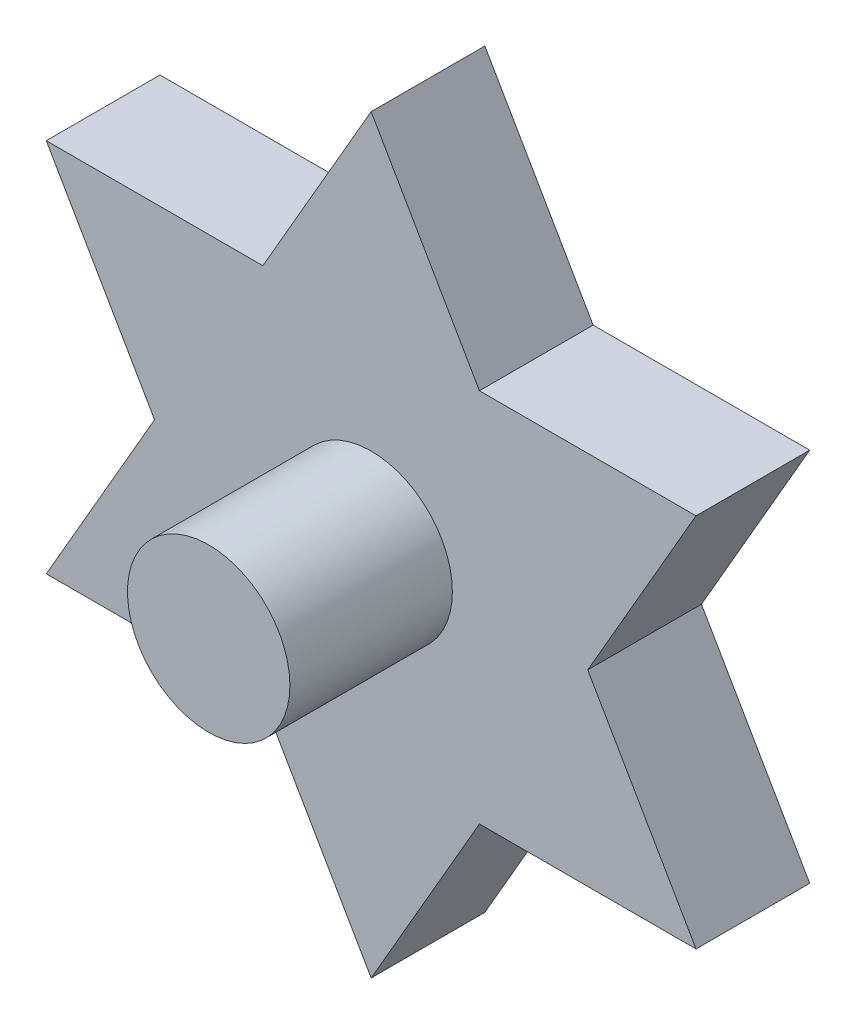
ISO-10303-21;
HEADER;
FILE_DESCRIPTION(('STEP AP214'),'2;1');
FILE_NAME('part.step','',(''),(''),'','','');
FILE_SCHEMA(('AUTOMOTIVE_DESIGN { 1 0 10303 214 1 1 1 1 }'));
ENDSEC;
DATA;
#1=APPLICATION_CONTEXT('core data for automotive mechanical design processes');
#2=APPLICATION_PROTOCOL_DEFINITION('international standard','automotive_design',2000,#1);
#3=PRODUCT_CONTEXT('',#1,'mechanical');
#4=PRODUCT('Part','Part','',(#3));
#5=PRODUCT_RELATED_PRODUCT_CATEGORY('part','',(#4));
#6=PRODUCT_DEFINITION_FORMATION('','',#4);
#7=PRODUCT_DEFINITION_CONTEXT('part definition',#1,'design');
#8=PRODUCT_DEFINITION('design','',#6,#7);
#9=PRODUCT_DEFINITION_SHAPE('','',#8);
#10=(LENGTH_UNIT() NAMED_UNIT(*) SI_UNIT(.MILLI.,.METRE.));
#11=(NAMED_UNIT(*) PLANE_ANGLE_UNIT() SI_UNIT($,.RADIAN.));
#12=(NAMED_UNIT(*) SI_UNIT($,.STERADIAN.) SOLID_ANGLE_UNIT());
#13=UNCERTAINTY_MEASURE_WITH_UNIT(LENGTH_MEASURE(1.E-05),#10,'distance_accuracy_value','');
#14=(GEOMETRIC_REPRESENTATION_CONTEXT(3) GLOBAL_UNCERTAINTY_ASSIGNED_CONTEXT((#13)) GLOBAL_UNIT_ASSIGNED_CONTEXT((#10,
#11,#12)) REPRESENTATION_CONTEXT('',''));
#15=CARTESIAN_POINT('',(0.,0.,0.));
#16=DIRECTION('',(0.,0.,1.));
#17=DIRECTION('',(1.,0.,0.));
#18=AXIS2_PLACEMENT_3D('',#15,#16,#17);
#19=CARTESIAN_POINT('',(-20.,-11.5470053837925,7.));
#20=DIRECTION('',(0.866025403784439,-0.5,0.));
#21=DIRECTION('',(0.5,0.866025403784439,0.));
#22=AXIS2_PLACEMENT_3D('',#19,#20,#21);
#23=PLANE('',#22);
#24=DIRECTION('',(-0.5,-0.866025403784439,0.));
#25=VECTOR('',#24,1.);
#26=CARTESIAN_POINT('',(-20.,-11.5470053837925,0.));
#27=LINE('',#26,#25);
#28=CARTESIAN_POINT('',(-13.3333333333333,0.,0.));
#29=VERTEX_POINT('',#28);
#30=CARTESIAN_POINT('',(-20.,-11.5470053837925,0.));
#31=VERTEX_POINT('',#30);
#32=EDGE_CURVE('E153',#29,#31,#27,.T.);
#33=ORIENTED_EDGE('',*,*,#32,.T.);
#34=DIRECTION('',(0.,0.,-1.));
#35=VECTOR('',#34,1.);
#36=CARTESIAN_POINT('',(-20.,-11.5470053837925,7.));
#37=LINE('',#36,#35);
#38=CARTESIAN_POINT('',(-20.,-11.5470053837925,7.));
#39=VERTEX_POINT('',#38);
#40=EDGE_CURVE('E11',#39,#31,#37,.T.);
#41=ORIENTED_EDGE('',*,*,#40,.F.);
#42=DIRECTION('',(-0.5,-0.866025403784439,0.));
#43=VECTOR('',#42,1.);
#44=CARTESIAN_POINT('',(-20.,-11.5470053837925,7.));
#45=LINE('',#44,#43);
#46=CARTESIAN_POINT('',(-13.3333333333333,0.,7.));
#47=VERTEX_POINT('',#46);
#48=EDGE_CURVE('E176',#47,#39,#45,.T.);
#49=ORIENTED_EDGE('',*,*,#48,.F.);
#50=DIRECTION('',(0.,0.,-1.));
#51=VECTOR('',#50,1.);
#52=CARTESIAN_POINT('',(-13.3333333333333,0.,7.));
#53=LINE('',#52,#51);
#54=EDGE_CURVE('E149',#47,#29,#53,.T.);
#55=ORIENTED_EDGE('',*,*,#54,.T.);
#56=EDGE_LOOP('',(#33,#41,#49,#55));
#57=FACE_BOUND('',#56,.T.);
#58=ADVANCED_FACE('F33',(#57),#23,.F.);
#59=CARTESIAN_POINT('',(-6.66666666666667,-11.5470053837925,7.));
#60=DIRECTION('',(0.,1.,0.));
#61=DIRECTION('',(0.,0.,1.));
#62=AXIS2_PLACEMENT_3D('',#59,#60,#61);
#63=PLANE('',#62);
#64=DIRECTION('',(1.,0.,0.));
#65=VECTOR('',#64,1.);
#66=CARTESIAN_POINT('',(-6.66666666666667,-11.5470053837925,0.));
#67=LINE('',#66,#65);
#68=CARTESIAN_POINT('',(-6.66666666666667,-11.5470053837925,0.));
#69=VERTEX_POINT('',#68);
#70=EDGE_CURVE('E156',#31,#69,#67,.T.);
#71=ORIENTED_EDGE('',*,*,#70,.T.);
#72=DIRECTION('',(0.,0.,-1.));
#73=VECTOR('',#72,1.);
#74=CARTESIAN_POINT('',(-6.66666666666667,-11.5470053837925,7.));
#75=LINE('',#74,#73);
#76=CARTESIAN_POINT('',(-6.66666666666667,-11.5470053837925,7.));
#77=VERTEX_POINT('',#76);
#78=EDGE_CURVE('E41',#77,#69,#75,.T.);
#79=ORIENTED_EDGE('',*,*,#78,.F.);
#80=DIRECTION('',(1.,0.,0.));
#81=VECTOR('',#80,1.);
#82=CARTESIAN_POINT('',(-6.66666666666667,-11.5470053837925,7.));
#83=LINE('',#82,#81);
#84=EDGE_CURVE('E104',#39,#77,#83,.T.);
#85=ORIENTED_EDGE('',*,*,#84,.F.);
#86=ORIENTED_EDGE('',*,*,#40,.T.);
#87=EDGE_LOOP('',(#71,#79,#85,#86));
#88=FACE_BOUND('',#87,.T.);
#89=ADVANCED_FACE('F255',(#88),#63,.F.);
#90=CARTESIAN_POINT('',(0.,-23.094010767585,7.));
#91=DIRECTION('',(0.866025403784439,0.5,0.));
#92=DIRECTION('',(-0.5,0.866025403784439,0.));
#93=AXIS2_PLACEMENT_3D('',#90,#91,#92);
#94=PLANE('',#93);
#95=DIRECTION('',(0.5,-0.866025403784439,0.));
#96=VECTOR('',#95,1.);
#97=CARTESIAN_POINT('',(0.,-23.094010767585,0.));
#98=LINE('',#97,#96);
#99=CARTESIAN_POINT('',(0.,-23.094010767585,0.));
#100=VERTEX_POINT('',#99);
#101=EDGE_CURVE('E159',#69,#100,#98,.T.);
#102=ORIENTED_EDGE('',*,*,#101,.T.);
#103=DIRECTION('',(0.,0.,-1.));
#104=VECTOR('',#103,1.);
#105=CARTESIAN_POINT('',(0.,-23.094010767585,7.));
#106=LINE('',#105,#104);
#107=CARTESIAN_POINT('',(0.,-23.094010767585,7.));
#108=VERTEX_POINT('',#107);
#109=EDGE_CURVE('E195',#108,#100,#106,.T.);
#110=ORIENTED_EDGE('',*,*,#109,.F.);
#111=DIRECTION('',(0.5,-0.866025403784439,0.));
#112=VECTOR('',#111,1.);
#113=CARTESIAN_POINT('',(0.,-23.094010767585,7.));
#114=LINE('',#113,#112);
#115=EDGE_CURVE('E203',#77,#108,#114,.T.);
#116=ORIENTED_EDGE('',*,*,#115,.F.);
#117=ORIENTED_EDGE('',*,*,#78,.T.);
#118=EDGE_LOOP('',(#102,#110,#116,#117));
#119=FACE_BOUND('',#118,.T.);
#120=ADVANCED_FACE('F201',(#119),#94,.F.);
#121=CARTESIAN_POINT('',(6.66666666666667,-11.5470053837925,7.));
#122=DIRECTION('',(-0.866025403784439,0.5,0.));
#123=DIRECTION('',(-0.5,-0.866025403784439,0.));
#124=AXIS2_PLACEMENT_3D('',#121,#122,#123);
#125=PLANE('',#124);
#126=DIRECTION('',(0.5,0.866025403784439,0.));
#127=VECTOR('',#126,1.);
#128=CARTESIAN_POINT('',(6.66666666666667,-11.5470053837925,0.));
#129=LINE('',#128,#127);
#130=CARTESIAN_POINT('',(6.66666666666667,-11.5470053837925,0.));
#131=VERTEX_POINT('',#130);
#132=EDGE_CURVE('E161',#100,#131,#129,.T.);
#133=ORIENTED_EDGE('',*,*,#132,.T.);
#134=DIRECTION('',(0.,0.,-1.));
#135=VECTOR('',#134,1.);
#136=CARTESIAN_POINT('',(6.66666666666667,-11.5470053837925,7.));
#137=LINE('',#136,#135);
#138=CARTESIAN_POINT('',(6.66666666666667,-11.5470053837925,7.));
#139=VERTEX_POINT('',#138);
#140=EDGE_CURVE('E192',#139,#131,#137,.T.);
#141=ORIENTED_EDGE('',*,*,#140,.F.);
#142=DIRECTION('',(0.5,0.866025403784439,0.));
#143=VECTOR('',#142,1.);
#144=CARTESIAN_POINT('',(6.66666666666667,-11.5470053837925,7.));
#145=LINE('',#144,#143);
#146=EDGE_CURVE('E221',#108,#139,#145,.T.);
#147=ORIENTED_EDGE('',*,*,#146,.F.);
#148=ORIENTED_EDGE('',*,*,#109,.T.);
#149=EDGE_LOOP('',(#133,#141,#147,#148));
#150=FACE_BOUND('',#149,.T.);
#151=ADVANCED_FACE('F212',(#150),#125,.F.);
#152=CARTESIAN_POINT('',(20.,-11.5470053837925,7.));
#153=DIRECTION('',(0.,1.,0.));
#154=DIRECTION('',(0.,0.,1.));
#155=AXIS2_PLACEMENT_3D('',#152,#153,#154);
#156=PLANE('',#155);
#157=DIRECTION('',(1.,0.,0.));
#158=VECTOR('',#157,1.);
#159=CARTESIAN_POINT('',(20.,-11.5470053837925,0.));
#160=LINE('',#159,#158);
#161=CARTESIAN_POINT('',(20.,-11.5470053837925,0.));
#162=VERTEX_POINT('',#161);
#163=EDGE_CURVE('E163',#131,#162,#160,.T.);
#164=ORIENTED_EDGE('',*,*,#163,.T.);
#165=DIRECTION('',(0.,0.,-1.));
#166=VECTOR('',#165,1.);
#167=CARTESIAN_POINT('',(20.,-11.5470053837925,7.));
#168=LINE('',#167,#166);
#169=CARTESIAN_POINT('',(20.,-11.5470053837925,7.));
#170=VERTEX_POINT('',#169);
#171=EDGE_CURVE('E189',#170,#162,#168,.T.);
#172=ORIENTED_EDGE('',*,*,#171,.F.);
#173=DIRECTION('',(1.,0.,0.));
#174=VECTOR('',#173,1.);
#175=CARTESIAN_POINT('',(20.,-11.5470053837925,7.));
#176=LINE('',#175,#174);
#177=EDGE_CURVE('E218',#139,#170,#176,.T.);
#178=ORIENTED_EDGE('',*,*,#177,.F.);
#179=ORIENTED_EDGE('',*,*,#140,.T.);
#180=EDGE_LOOP('',(#164,#172,#178,#179));
#181=FACE_BOUND('',#180,.T.);
#182=ADVANCED_FACE('F216',(#181),#156,.F.);
#183=CARTESIAN_POINT('',(13.3333333333333,0.,7.));
#184=DIRECTION('',(-0.866025403784439,-0.5,0.));
#185=DIRECTION('',(0.5,-0.866025403784439,0.));
#186=AXIS2_PLACEMENT_3D('',#183,#184,#185);
#187=PLANE('',#186);
#188=DIRECTION('',(-0.5,0.866025403784439,0.));
#189=VECTOR('',#188,1.);
#190=CARTESIAN_POINT('',(13.3333333333333,0.,0.));
#191=LINE('',#190,#189);
#192=CARTESIAN_POINT('',(13.3333333333333,0.,0.));
#193=VERTEX_POINT('',#192);
#194=EDGE_CURVE('E165',#162,#193,#191,.T.);
#195=ORIENTED_EDGE('',*,*,#194,.T.);
#196=DIRECTION('',(0.,0.,-1.));
#197=VECTOR('',#196,1.);
#198=CARTESIAN_POINT('',(13.3333333333333,0.,7.));
#199=LINE('',#198,#197);
#200=CARTESIAN_POINT('',(13.3333333333333,0.,7.));
#201=VERTEX_POINT('',#200);
#202=EDGE_CURVE('E186',#201,#193,#199,.T.);
#203=ORIENTED_EDGE('',*,*,#202,.F.);
#204=DIRECTION('',(-0.5,0.866025403784439,0.));
#205=VECTOR('',#204,1.);
#206=CARTESIAN_POINT('',(13.3333333333333,0.,7.));
#207=LINE('',#206,#205);
#208=EDGE_CURVE('E220',#170,#201,#207,.T.);
#209=ORIENTED_EDGE('',*,*,#208,.F.);
#210=ORIENTED_EDGE('',*,*,#171,.T.);
#211=EDGE_LOOP('',(#195,#203,#209,#210));
#212=FACE_BOUND('',#211,.T.);
#213=ADVANCED_FACE('F268',(#212),#187,.F.);
#214=CARTESIAN_POINT('',(20.,11.5470053837925,7.));
#215=DIRECTION('',(-0.866025403784439,0.5,0.));
#216=DIRECTION('',(-0.5,-0.866025403784439,0.));
#217=AXIS2_PLACEMENT_3D('',#214,#215,#216);
#218=PLANE('',#217);
#219=DIRECTION('',(0.5,0.866025403784439,0.));
#220=VECTOR('',#219,1.);
#221=CARTESIAN_POINT('',(20.,11.5470053837925,0.));
#222=LINE('',#221,#220);
#223=CARTESIAN_POINT('',(20.,11.5470053837925,0.));
#224=VERTEX_POINT('',#223);
#225=EDGE_CURVE('E167',#193,#224,#222,.T.);
#226=ORIENTED_EDGE('',*,*,#225,.T.);
#227=DIRECTION('',(0.,0.,-1.));
#228=VECTOR('',#227,1.);
#229=CARTESIAN_POINT('',(20.,11.5470053837925,7.));
#230=LINE('',#229,#228);
#231=CARTESIAN_POINT('',(20.,11.5470053837925,7.));
#232=VERTEX_POINT('',#231);
#233=EDGE_CURVE('E183',#232,#224,#230,.T.);
#234=ORIENTED_EDGE('',*,*,#233,.F.);
#235=DIRECTION('',(0.5,0.866025403784439,0.));
#236=VECTOR('',#235,1.);
#237=CARTESIAN_POINT('',(20.,11.5470053837925,7.));
#238=LINE('',#237,#236);
#239=EDGE_CURVE('E223',#201,#232,#238,.T.);
#240=ORIENTED_EDGE('',*,*,#239,.F.);
#241=ORIENTED_EDGE('',*,*,#202,.T.);
#242=EDGE_LOOP('',(#226,#234,#240,#241));
#243=FACE_BOUND('',#242,.T.);
#244=ADVANCED_FACE('F271',(#243),#218,.F.);
#245=CARTESIAN_POINT('',(6.66666666666667,11.5470053837925,7.));
#246=DIRECTION('',(0.,-1.,0.));
#247=DIRECTION('',(0.,0.,-1.));
#248=AXIS2_PLACEMENT_3D('',#245,#246,#247);
#249=PLANE('',#248);
#250=DIRECTION('',(-1.,0.,0.));
#251=VECTOR('',#250,1.);
#252=CARTESIAN_POINT('',(6.66666666666667,11.5470053837925,0.));
#253=LINE('',#252,#251);
#254=CARTESIAN_POINT('',(6.66666666666667,11.5470053837925,0.));
#255=VERTEX_POINT('',#254);
#256=EDGE_CURVE('E169',#224,#255,#253,.T.);
#257=ORIENTED_EDGE('',*,*,#256,.T.);
#258=DIRECTION('',(0.,0.,-1.));
#259=VECTOR('',#258,1.);
#260=CARTESIAN_POINT('',(6.66666666666667,11.5470053837925,7.));
#261=LINE('',#260,#259);
#262=CARTESIAN_POINT('',(6.66666666666667,11.5470053837925,7.));
#263=VERTEX_POINT('',#262);
#264=EDGE_CURVE('E180',#263,#255,#261,.T.);
#265=ORIENTED_EDGE('',*,*,#264,.F.);
#266=DIRECTION('',(-1.,0.,0.));
#267=VECTOR('',#266,1.);
#268=CARTESIAN_POINT('',(6.66666666666667,11.5470053837925,7.));
#269=LINE('',#268,#267);
#270=EDGE_CURVE('E229',#232,#263,#269,.T.);
#271=ORIENTED_EDGE('',*,*,#270,.F.);
#272=ORIENTED_EDGE('',*,*,#233,.T.);
#273=EDGE_LOOP('',(#257,#265,#271,#272));
#274=FACE_BOUND('',#273,.T.);
#275=ADVANCED_FACE('F235',(#274),#249,.F.);
#276=CARTESIAN_POINT('',(0.,23.094010767585,7.));
#277=DIRECTION('',(-0.866025403784438,-0.5,0.));
#278=DIRECTION('',(0.5,-0.866025403784439,0.));
#279=AXIS2_PLACEMENT_3D('',#276,#277,#278);
#280=PLANE('',#279);
#281=DIRECTION('',(-0.5,0.866025403784438,0.));
#282=VECTOR('',#281,1.);
#283=CARTESIAN_POINT('',(0.,23.094010767585,0.));
#284=LINE('',#283,#282);
#285=CARTESIAN_POINT('',(0.,23.094010767585,0.));
#286=VERTEX_POINT('',#285);
#287=EDGE_CURVE('E171',#255,#286,#284,.T.);
#288=ORIENTED_EDGE('',*,*,#287,.T.);
#289=DIRECTION('',(0.,0.,-1.));
#290=VECTOR('',#289,1.);
#291=CARTESIAN_POINT('',(0.,23.094010767585,7.));
#292=LINE('',#291,#290);
#293=CARTESIAN_POINT('',(0.,23.094010767585,7.));
#294=VERTEX_POINT('',#293);
#295=EDGE_CURVE('E144',#294,#286,#292,.T.);
#296=ORIENTED_EDGE('',*,*,#295,.F.);
#297=DIRECTION('',(-0.5,0.866025403784438,0.));
#298=VECTOR('',#297,1.);
#299=CARTESIAN_POINT('',(0.,23.094010767585,7.));
#300=LINE('',#299,#298);
#301=EDGE_CURVE('E135',#263,#294,#300,.T.);
#302=ORIENTED_EDGE('',*,*,#301,.F.);
#303=ORIENTED_EDGE('',*,*,#264,.T.);
#304=EDGE_LOOP('',(#288,#296,#302,#303));
#305=FACE_BOUND('',#304,.T.);
#306=ADVANCED_FACE('F239',(#305),#280,.F.);
#307=CARTESIAN_POINT('',(-6.66666666666667,11.5470053837925,7.));
#308=DIRECTION('',(0.866025403784438,-0.5,0.));
#309=DIRECTION('',(0.5,0.866025403784439,0.));
#310=AXIS2_PLACEMENT_3D('',#307,#308,#309);
#311=PLANE('',#310);
#312=DIRECTION('',(-0.5,-0.866025403784438,0.));
#313=VECTOR('',#312,1.);
#314=CARTESIAN_POINT('',(-6.66666666666667,11.5470053837925,0.));
#315=LINE('',#314,#313);
#316=CARTESIAN_POINT('',(-6.66666666666667,11.5470053837925,0.));
#317=VERTEX_POINT('',#316);
#318=EDGE_CURVE('E143',#286,#317,#315,.T.);
#319=ORIENTED_EDGE('',*,*,#318,.T.);
#320=DIRECTION('',(0.,0.,-1.));
#321=VECTOR('',#320,1.);
#322=CARTESIAN_POINT('',(-6.66666666666667,11.5470053837925,7.));
#323=LINE('',#322,#321);
#324=CARTESIAN_POINT('',(-6.66666666666667,11.5470053837925,7.));
#325=VERTEX_POINT('',#324);
#326=EDGE_CURVE('E140',#325,#317,#323,.T.);
#327=ORIENTED_EDGE('',*,*,#326,.F.);
#328=DIRECTION('',(-0.5,-0.866025403784438,0.));
#329=VECTOR('',#328,1.);
#330=CARTESIAN_POINT('',(-6.66666666666667,11.5470053837925,7.));
#331=LINE('',#330,#329);
#332=EDGE_CURVE('E129',#294,#325,#331,.T.);
#333=ORIENTED_EDGE('',*,*,#332,.F.);
#334=ORIENTED_EDGE('',*,*,#295,.T.);
#335=EDGE_LOOP('',(#319,#327,#333,#334));
#336=FACE_BOUND('',#335,.T.);
#337=ADVANCED_FACE('F141',(#336),#311,.F.);
#338=CARTESIAN_POINT('',(-20.,11.5470053837925,7.));
#339=DIRECTION('',(0.,-1.,0.));
#340=DIRECTION('',(0.,0.,-1.));
#341=AXIS2_PLACEMENT_3D('',#338,#339,#340);
#342=PLANE('',#341);
#343=DIRECTION('',(-1.,0.,0.));
#344=VECTOR('',#343,1.);
#345=CARTESIAN_POINT('',(-20.,11.5470053837925,0.));
#346=LINE('',#345,#344);
#347=CARTESIAN_POINT('',(-20.,11.5470053837925,0.));
#348=VERTEX_POINT('',#347);
#349=EDGE_CURVE('E90',#317,#348,#346,.T.);
#350=ORIENTED_EDGE('',*,*,#349,.T.);
#351=DIRECTION('',(0.,0.,-1.));
#352=VECTOR('',#351,1.);
#353=CARTESIAN_POINT('',(-20.,11.5470053837925,7.));
#354=LINE('',#353,#352);
#355=CARTESIAN_POINT('',(-20.,11.5470053837925,7.));
#356=VERTEX_POINT('',#355);
#357=EDGE_CURVE('E145',#356,#348,#354,.T.);
#358=ORIENTED_EDGE('',*,*,#357,.F.);
#359=DIRECTION('',(-1.,0.,0.));
#360=VECTOR('',#359,1.);
#361=CARTESIAN_POINT('',(-20.,11.5470053837925,7.));
#362=LINE('',#361,#360);
#363=EDGE_CURVE('E133',#325,#356,#362,.T.);
#364=ORIENTED_EDGE('',*,*,#363,.F.);
#365=ORIENTED_EDGE('',*,*,#326,.T.);
#366=EDGE_LOOP('',(#350,#358,#364,#365));
#367=FACE_BOUND('',#366,.T.);
#368=ADVANCED_FACE('F147',(#367),#342,.F.);
#369=CARTESIAN_POINT('',(-13.3333333333333,0.,7.));
#370=DIRECTION('',(0.866025403784439,0.5,0.));
#371=DIRECTION('',(-0.5,0.866025403784439,0.));
#372=AXIS2_PLACEMENT_3D('',#369,#370,#371);
#373=PLANE('',#372);
#374=DIRECTION('',(0.5,-0.866025403784439,0.));
#375=VECTOR('',#374,1.);
#376=CARTESIAN_POINT('',(-13.3333333333333,0.,0.));
#377=LINE('',#376,#375);
#378=EDGE_CURVE('E96',#348,#29,#377,.T.);
#379=ORIENTED_EDGE('',*,*,#378,.T.);
#380=ORIENTED_EDGE('',*,*,#54,.F.);
#381=DIRECTION('',(0.5,-0.866025403784439,0.));
#382=VECTOR('',#381,1.);
#383=CARTESIAN_POINT('',(-13.3333333333333,0.,7.));
#384=LINE('',#383,#382);
#385=EDGE_CURVE('E49',#356,#47,#384,.T.);
#386=ORIENTED_EDGE('',*,*,#385,.F.);
#387=ORIENTED_EDGE('',*,*,#357,.T.);
#388=EDGE_LOOP('',(#379,#380,#386,#387));
#389=FACE_BOUND('',#388,.T.);
#390=ADVANCED_FACE('F243',(#389),#373,.F.);
#391=CARTESIAN_POINT('',(0.,0.,7.));
#392=DIRECTION('',(0.,0.,1.));
#393=DIRECTION('',(1.,0.,0.));
#394=AXIS2_PLACEMENT_3D('',#391,#392,#393);
#395=PLANE('',#394);
#396=CARTESIAN_POINT('',(0.,0.,7.));
#397=DIRECTION('',(0.,0.,1.));
#398=DIRECTION('',(1.,0.,0.));
#399=AXIS2_PLACEMENT_3D('',#396,#397,#398);
#400=CIRCLE('',#399,5.);
#401=CARTESIAN_POINT('',(5.,0.,7.));
#402=VERTEX_POINT('',#401);
#403=EDGE_CURVE('E332',#402,#402,#400,.T.);
#404=ORIENTED_EDGE('',*,*,#403,.F.);
#405=EDGE_LOOP('',(#404));
#406=FACE_BOUND('',#405,.T.);
#407=ORIENTED_EDGE('',*,*,#48,.T.);
#408=ORIENTED_EDGE('',*,*,#84,.T.);
#409=ORIENTED_EDGE('',*,*,#115,.T.);
#410=ORIENTED_EDGE('',*,*,#146,.T.);
#411=ORIENTED_EDGE('',*,*,#177,.T.);
#412=ORIENTED_EDGE('',*,*,#208,.T.);
#413=ORIENTED_EDGE('',*,*,#239,.T.);
#414=ORIENTED_EDGE('',*,*,#270,.T.);
#415=ORIENTED_EDGE('',*,*,#301,.T.);
#416=ORIENTED_EDGE('',*,*,#332,.T.);
#417=ORIENTED_EDGE('',*,*,#363,.T.);
#418=ORIENTED_EDGE('',*,*,#385,.T.);
#419=EDGE_LOOP('',(#407,#408,#409,#410,#411,#412,#413,#414,#415,#416,#417,#418));
#420=FACE_BOUND('',#419,.T.);
#421=ADVANCED_FACE('F131',(#406,#420),#395,.T.);
#422=CARTESIAN_POINT('',(0.,0.,0.));
#423=DIRECTION('',(0.,0.,1.));
#424=DIRECTION('',(1.,0.,0.));
#425=AXIS2_PLACEMENT_3D('',#422,#423,#424);
#426=PLANE('',#425);
#427=ORIENTED_EDGE('',*,*,#32,.F.);
#428=ORIENTED_EDGE('',*,*,#378,.F.);
#429=ORIENTED_EDGE('',*,*,#349,.F.);
#430=ORIENTED_EDGE('',*,*,#318,.F.);
#431=ORIENTED_EDGE('',*,*,#287,.F.);
#432=ORIENTED_EDGE('',*,*,#256,.F.);
#433=ORIENTED_EDGE('',*,*,#225,.F.);
#434=ORIENTED_EDGE('',*,*,#194,.F.);
#435=ORIENTED_EDGE('',*,*,#163,.F.);
#436=ORIENTED_EDGE('',*,*,#132,.F.);
#437=ORIENTED_EDGE('',*,*,#101,.F.);
#438=ORIENTED_EDGE('',*,*,#70,.F.);
#439=EDGE_LOOP('',(#427,#428,#429,#430,#431,#432,#433,#434,#435,#436,#437,#438));
#440=FACE_BOUND('',#439,.T.);
#441=ADVANCED_FACE('F207',(#440),#426,.F.);
#442=CARTESIAN_POINT('',(0.,0.,17.));
#443=DIRECTION('',(0.,0.,-1.));
#444=DIRECTION('',(-1.,0.,0.));
#445=AXIS2_PLACEMENT_3D('',#442,#443,#444);
#446=CYLINDRICAL_SURFACE('',#445,5.);
#447=CARTESIAN_POINT('',(0.,0.,17.));
#448=DIRECTION('',(0.,0.,1.));
#449=DIRECTION('',(1.,0.,0.));
#450=AXIS2_PLACEMENT_3D('',#447,#448,#449);
#451=CIRCLE('',#450,5.);
#452=CARTESIAN_POINT('',(5.,0.,17.));
#453=VERTEX_POINT('',#452);
#454=EDGE_CURVE('E157',#453,#453,#451,.T.);
#455=ORIENTED_EDGE('',*,*,#454,.F.);
#456=EDGE_LOOP('',(#455));
#457=FACE_BOUND('',#456,.T.);
#458=ORIENTED_EDGE('',*,*,#403,.T.);
#459=EDGE_LOOP('',(#458));
#460=FACE_BOUND('',#459,.T.);
#461=ADVANCED_FACE('F303',(#457,#460),#446,.T.);
#462=CARTESIAN_POINT('',(0.,0.,17.));
#463=DIRECTION('',(0.,0.,1.));
#464=DIRECTION('',(1.,0.,0.));
#465=AXIS2_PLACEMENT_3D('',#462,#463,#464);
#466=PLANE('',#465);
#467=ORIENTED_EDGE('',*,*,#454,.T.);
#468=EDGE_LOOP('',(#467));
#469=FACE_BOUND('',#468,.T.);
#470=ADVANCED_FACE('F316',(#469),#466,.T.);
#471=CLOSED_SHELL('',(#58,#89,#120,#151,#182,#213,#244,#275,#306,#337,#368,#390,#421,#441,#461,#470));
#472=MANIFOLD_SOLID_BREP('B2',#471);
#473=ADVANCED_BREP_SHAPE_REPRESENTATION('',(#18,#472),#14);
#474=SHAPE_DEFINITION_REPRESENTATION(#9,#473);
ENDSEC;
END-ISO-10303-21;
